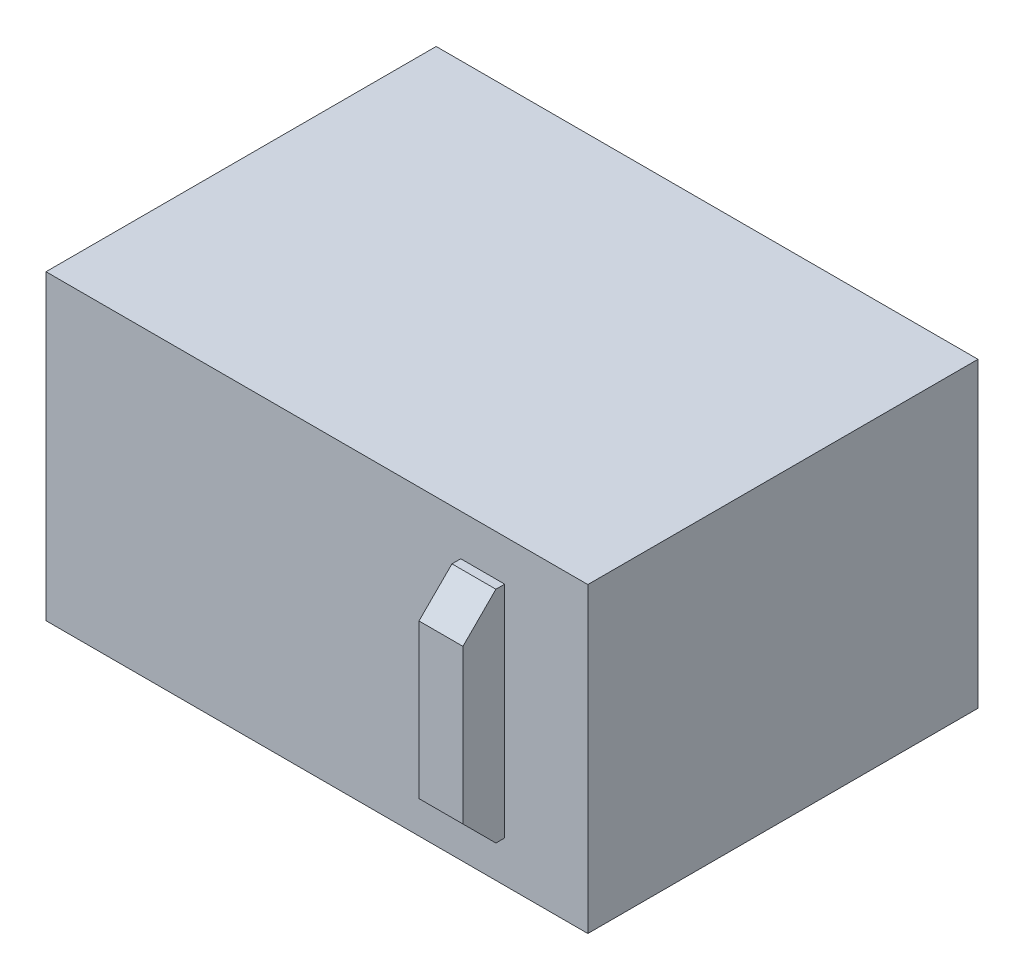
ISO-10303-21;
HEADER;
FILE_DESCRIPTION(('STEP AP214'),'2;1');
FILE_NAME('part.step','',(''),(''),'','','');
FILE_SCHEMA(('AUTOMOTIVE_DESIGN { 1 0 10303 214 1 1 1 1 }'));
ENDSEC;
DATA;
#1=APPLICATION_CONTEXT('core data for automotive mechanical design processes');
#2=APPLICATION_PROTOCOL_DEFINITION('international standard','automotive_design',2000,#1);
#3=PRODUCT_CONTEXT('',#1,'mechanical');
#4=PRODUCT('Part','Part','',(#3));
#5=PRODUCT_RELATED_PRODUCT_CATEGORY('part','',(#4));
#6=PRODUCT_DEFINITION_FORMATION('','',#4);
#7=PRODUCT_DEFINITION_CONTEXT('part definition',#1,'design');
#8=PRODUCT_DEFINITION('design','',#6,#7);
#9=PRODUCT_DEFINITION_SHAPE('','',#8);
#10=(LENGTH_UNIT() NAMED_UNIT(*) SI_UNIT(.MILLI.,.METRE.));
#11=(NAMED_UNIT(*) PLANE_ANGLE_UNIT() SI_UNIT($,.RADIAN.));
#12=(NAMED_UNIT(*) SI_UNIT($,.STERADIAN.) SOLID_ANGLE_UNIT());
#13=UNCERTAINTY_MEASURE_WITH_UNIT(LENGTH_MEASURE(1.E-05),#10,'distance_accuracy_value','');
#14=(GEOMETRIC_REPRESENTATION_CONTEXT(3) GLOBAL_UNCERTAINTY_ASSIGNED_CONTEXT((#13)) GLOBAL_UNIT_ASSIGNED_CONTEXT((#10,
#11,#12)) REPRESENTATION_CONTEXT('',''));
#15=CARTESIAN_POINT('',(0.,0.,0.));
#16=DIRECTION('',(0.,0.,1.));
#17=DIRECTION('',(1.,0.,0.));
#18=AXIS2_PLACEMENT_3D('',#15,#16,#17);
#19=CARTESIAN_POINT('',(246.5,275.,177.5));
#20=DIRECTION('',(0.,0.,-1.));
#21=DIRECTION('',(-1.,0.,0.));
#22=AXIS2_PLACEMENT_3D('',#19,#20,#21);
#23=PLANE('',#22);
#24=DIRECTION('',(1.,0.,0.));
#25=VECTOR('',#24,1.);
#26=CARTESIAN_POINT('',(246.5,0.,177.5));
#27=LINE('',#26,#25);
#28=CARTESIAN_POINT('',(-246.5,0.,177.5));
#29=VERTEX_POINT('',#28);
#30=CARTESIAN_POINT('',(246.5,0.,177.5));
#31=VERTEX_POINT('',#30);
#32=EDGE_CURVE('E156',#29,#31,#27,.T.);
#33=ORIENTED_EDGE('',*,*,#32,.T.);
#34=DIRECTION('',(0.,-1.,0.));
#35=VECTOR('',#34,1.);
#36=CARTESIAN_POINT('',(246.5,275.,177.5));
#37=LINE('',#36,#35);
#38=CARTESIAN_POINT('',(246.5,275.,177.5));
#39=VERTEX_POINT('',#38);
#40=EDGE_CURVE('E166',#39,#31,#37,.T.);
#41=ORIENTED_EDGE('',*,*,#40,.F.);
#42=DIRECTION('',(1.,0.,0.));
#43=VECTOR('',#42,1.);
#44=CARTESIAN_POINT('',(246.5,275.,177.5));
#45=LINE('',#44,#43);
#46=CARTESIAN_POINT('',(-246.5,275.,177.5));
#47=VERTEX_POINT('',#46);
#48=EDGE_CURVE('E146',#47,#39,#45,.T.);
#49=ORIENTED_EDGE('',*,*,#48,.F.);
#50=DIRECTION('',(0.,-1.,0.));
#51=VECTOR('',#50,1.);
#52=CARTESIAN_POINT('',(-246.5,275.,177.5));
#53=LINE('',#52,#51);
#54=EDGE_CURVE('E169',#47,#29,#53,.T.);
#55=ORIENTED_EDGE('',*,*,#54,.T.);
#56=EDGE_LOOP('',(#33,#41,#49,#55));
#57=FACE_BOUND('',#56,.T.);
#58=DIRECTION('',(0.,-1.,0.));
#59=VECTOR('',#58,1.);
#60=CARTESIAN_POINT('',(130.868479838721,37.5000000000001,177.5));
#61=LINE('',#60,#59);
#62=CARTESIAN_POINT('',(130.868479838721,237.5,177.5));
#63=VERTEX_POINT('',#62);
#64=CARTESIAN_POINT('',(130.868479838721,37.5000000000001,177.5));
#65=VERTEX_POINT('',#64);
#66=EDGE_CURVE('E111',#63,#65,#61,.T.);
#67=ORIENTED_EDGE('',*,*,#66,.F.);
#68=DIRECTION('',(-1.,0.,0.));
#69=VECTOR('',#68,1.);
#70=CARTESIAN_POINT('',(170.868479838721,237.5,177.5));
#71=LINE('',#70,#69);
#72=CARTESIAN_POINT('',(170.868479838721,237.5,177.5));
#73=VERTEX_POINT('',#72);
#74=EDGE_CURVE('E122',#73,#63,#71,.T.);
#75=ORIENTED_EDGE('',*,*,#74,.F.);
#76=DIRECTION('',(0.,1.,0.));
#77=VECTOR('',#76,1.);
#78=CARTESIAN_POINT('',(170.868479838721,37.5000000000001,177.5));
#79=LINE('',#78,#77);
#80=CARTESIAN_POINT('',(170.868479838721,37.5000000000001,177.5));
#81=VERTEX_POINT('',#80);
#82=EDGE_CURVE('E130',#81,#73,#79,.T.);
#83=ORIENTED_EDGE('',*,*,#82,.F.);
#84=DIRECTION('',(1.,0.,0.));
#85=VECTOR('',#84,1.);
#86=CARTESIAN_POINT('',(170.868479838721,37.5000000000001,177.5));
#87=LINE('',#86,#85);
#88=EDGE_CURVE('E125',#65,#81,#87,.T.);
#89=ORIENTED_EDGE('',*,*,#88,.F.);
#90=EDGE_LOOP('',(#67,#75,#83,#89));
#91=FACE_BOUND('',#90,.T.);
#92=ADVANCED_FACE('F33',(#57,#91),#23,.F.);
#93=CARTESIAN_POINT('',(-246.5,275.,177.5));
#94=DIRECTION('',(1.,0.,0.));
#95=DIRECTION('',(0.,0.,-1.));
#96=AXIS2_PLACEMENT_3D('',#93,#94,#95);
#97=PLANE('',#96);
#98=DIRECTION('',(0.,0.,1.));
#99=VECTOR('',#98,1.);
#100=CARTESIAN_POINT('',(-246.5,0.,177.5));
#101=LINE('',#100,#99);
#102=CARTESIAN_POINT('',(-246.5,0.,-177.5));
#103=VERTEX_POINT('',#102);
#104=EDGE_CURVE('E142',#103,#29,#101,.T.);
#105=ORIENTED_EDGE('',*,*,#104,.T.);
#106=ORIENTED_EDGE('',*,*,#54,.F.);
#107=DIRECTION('',(0.,0.,1.));
#108=VECTOR('',#107,1.);
#109=CARTESIAN_POINT('',(-246.5,275.,177.5));
#110=LINE('',#109,#108);
#111=CARTESIAN_POINT('',(-246.5,275.,-177.5));
#112=VERTEX_POINT('',#111);
#113=EDGE_CURVE('E143',#112,#47,#110,.T.);
#114=ORIENTED_EDGE('',*,*,#113,.F.);
#115=DIRECTION('',(0.,-1.,0.));
#116=VECTOR('',#115,1.);
#117=CARTESIAN_POINT('',(-246.5,275.,-177.5));
#118=LINE('',#117,#116);
#119=EDGE_CURVE('E153',#112,#103,#118,.T.);
#120=ORIENTED_EDGE('',*,*,#119,.T.);
#121=EDGE_LOOP('',(#105,#106,#114,#120));
#122=FACE_BOUND('',#121,.T.);
#123=ADVANCED_FACE('F203',(#122),#97,.F.);
#124=CARTESIAN_POINT('',(246.5,275.,177.5));
#125=DIRECTION('',(-1.,0.,0.));
#126=DIRECTION('',(0.,0.,1.));
#127=AXIS2_PLACEMENT_3D('',#124,#125,#126);
#128=PLANE('',#127);
#129=DIRECTION('',(0.,0.,-1.));
#130=VECTOR('',#129,1.);
#131=CARTESIAN_POINT('',(246.5,0.,177.5));
#132=LINE('',#131,#130);
#133=CARTESIAN_POINT('',(246.5,0.,-177.5));
#134=VERTEX_POINT('',#133);
#135=EDGE_CURVE('E158',#31,#134,#132,.T.);
#136=ORIENTED_EDGE('',*,*,#135,.T.);
#137=DIRECTION('',(0.,-1.,0.));
#138=VECTOR('',#137,1.);
#139=CARTESIAN_POINT('',(246.5,275.,-177.5));
#140=LINE('',#139,#138);
#141=CARTESIAN_POINT('',(246.5,275.,-177.5));
#142=VERTEX_POINT('',#141);
#143=EDGE_CURVE('E163',#142,#134,#140,.T.);
#144=ORIENTED_EDGE('',*,*,#143,.F.);
#145=DIRECTION('',(0.,0.,-1.));
#146=VECTOR('',#145,1.);
#147=CARTESIAN_POINT('',(246.5,275.,177.5));
#148=LINE('',#147,#146);
#149=EDGE_CURVE('E149',#39,#142,#148,.T.);
#150=ORIENTED_EDGE('',*,*,#149,.F.);
#151=ORIENTED_EDGE('',*,*,#40,.T.);
#152=EDGE_LOOP('',(#136,#144,#150,#151));
#153=FACE_BOUND('',#152,.T.);
#154=ADVANCED_FACE('F209',(#153),#128,.F.);
#155=CARTESIAN_POINT('',(246.5,275.,-177.5));
#156=DIRECTION('',(0.,0.,1.));
#157=DIRECTION('',(1.,0.,0.));
#158=AXIS2_PLACEMENT_3D('',#155,#156,#157);
#159=PLANE('',#158);
#160=DIRECTION('',(-1.,0.,0.));
#161=VECTOR('',#160,1.);
#162=CARTESIAN_POINT('',(246.5,0.,-177.5));
#163=LINE('',#162,#161);
#164=EDGE_CURVE('E147',#134,#103,#163,.T.);
#165=ORIENTED_EDGE('',*,*,#164,.T.);
#166=ORIENTED_EDGE('',*,*,#119,.F.);
#167=DIRECTION('',(-1.,0.,0.));
#168=VECTOR('',#167,1.);
#169=CARTESIAN_POINT('',(246.5,275.,-177.5));
#170=LINE('',#169,#168);
#171=EDGE_CURVE('E151',#142,#112,#170,.T.);
#172=ORIENTED_EDGE('',*,*,#171,.F.);
#173=ORIENTED_EDGE('',*,*,#143,.T.);
#174=EDGE_LOOP('',(#165,#166,#172,#173));
#175=FACE_BOUND('',#174,.T.);
#176=ADVANCED_FACE('F215',(#175),#159,.F.);
#177=CARTESIAN_POINT('',(0.,275.,0.));
#178=DIRECTION('',(0.,1.,0.));
#179=DIRECTION('',(0.,0.,1.));
#180=AXIS2_PLACEMENT_3D('',#177,#178,#179);
#181=PLANE('',#180);
#182=ORIENTED_EDGE('',*,*,#113,.T.);
#183=ORIENTED_EDGE('',*,*,#48,.T.);
#184=ORIENTED_EDGE('',*,*,#149,.T.);
#185=ORIENTED_EDGE('',*,*,#171,.T.);
#186=EDGE_LOOP('',(#182,#183,#184,#185));
#187=FACE_BOUND('',#186,.T.);
#188=ADVANCED_FACE('F219',(#187),#181,.T.);
#189=CARTESIAN_POINT('',(0.,0.,0.));
#190=DIRECTION('',(0.,1.,0.));
#191=DIRECTION('',(0.,0.,1.));
#192=AXIS2_PLACEMENT_3D('',#189,#190,#191);
#193=PLANE('',#192);
#194=ORIENTED_EDGE('',*,*,#104,.F.);
#195=ORIENTED_EDGE('',*,*,#164,.F.);
#196=ORIENTED_EDGE('',*,*,#135,.F.);
#197=ORIENTED_EDGE('',*,*,#32,.F.);
#198=EDGE_LOOP('',(#194,#195,#196,#197));
#199=FACE_BOUND('',#198,.T.);
#200=ADVANCED_FACE('F221',(#199),#193,.F.);
#201=CARTESIAN_POINT('',(130.868479838721,37.5000000000001,215.5));
#202=DIRECTION('',(1.,0.,0.));
#203=DIRECTION('',(0.,0.,-1.));
#204=AXIS2_PLACEMENT_3D('',#201,#202,#203);
#205=PLANE('',#204);
#206=DIRECTION('',(0.,0.,-1.));
#207=VECTOR('',#206,1.);
#208=CARTESIAN_POINT('',(130.868479838721,37.5000000000001,215.5));
#209=LINE('',#208,#207);
#210=CARTESIAN_POINT('',(130.868479838721,37.5000000000001,185.5));
#211=VERTEX_POINT('',#210);
#212=EDGE_CURVE('E140',#211,#65,#209,.T.);
#213=ORIENTED_EDGE('',*,*,#212,.F.);
#214=DIRECTION('',(0.,0.707106781186546,0.707106781186549));
#215=VECTOR('',#214,1.);
#216=CARTESIAN_POINT('',(130.868479838721,67.5000000000002,215.5));
#217=LINE('',#216,#215);
#218=CARTESIAN_POINT('',(130.868479838721,67.5000000000002,215.5));
#219=VERTEX_POINT('',#218);
#220=EDGE_CURVE('E41',#211,#219,#217,.T.);
#221=ORIENTED_EDGE('',*,*,#220,.T.);
#222=DIRECTION('',(0.,-1.,0.));
#223=VECTOR('',#222,1.);
#224=CARTESIAN_POINT('',(130.868479838721,37.5000000000001,215.5));
#225=LINE('',#224,#223);
#226=CARTESIAN_POINT('',(130.868479838721,207.5,215.5));
#227=VERTEX_POINT('',#226);
#228=EDGE_CURVE('E129',#227,#219,#225,.T.);
#229=ORIENTED_EDGE('',*,*,#228,.F.);
#230=DIRECTION('',(0.,0.707106781186546,-0.707106781186549));
#231=VECTOR('',#230,1.);
#232=CARTESIAN_POINT('',(130.868479838721,207.5,215.5));
#233=LINE('',#232,#231);
#234=CARTESIAN_POINT('',(130.868479838721,237.5,185.5));
#235=VERTEX_POINT('',#234);
#236=EDGE_CURVE('E48',#227,#235,#233,.T.);
#237=ORIENTED_EDGE('',*,*,#236,.T.);
#238=DIRECTION('',(0.,0.,-1.));
#239=VECTOR('',#238,1.);
#240=CARTESIAN_POINT('',(130.868479838721,237.5,215.5));
#241=LINE('',#240,#239);
#242=EDGE_CURVE('E108',#235,#63,#241,.T.);
#243=ORIENTED_EDGE('',*,*,#242,.T.);
#244=ORIENTED_EDGE('',*,*,#66,.T.);
#245=EDGE_LOOP('',(#213,#221,#229,#237,#243,#244));
#246=FACE_BOUND('',#245,.T.);
#247=ADVANCED_FACE('F110',(#246),#205,.F.);
#248=CARTESIAN_POINT('',(170.868479838721,37.5000000000001,215.5));
#249=DIRECTION('',(0.,1.,0.));
#250=DIRECTION('',(-1.,0.,0.));
#251=AXIS2_PLACEMENT_3D('',#248,#249,#250);
#252=PLANE('',#251);
#253=DIRECTION('',(0.,0.,-1.));
#254=VECTOR('',#253,1.);
#255=CARTESIAN_POINT('',(170.868479838721,37.5000000000001,215.5));
#256=LINE('',#255,#254);
#257=CARTESIAN_POINT('',(170.868479838721,37.5000000000001,185.5));
#258=VERTEX_POINT('',#257);
#259=EDGE_CURVE('E138',#258,#81,#256,.T.);
#260=ORIENTED_EDGE('',*,*,#259,.F.);
#261=DIRECTION('',(-1.,0.,0.));
#262=VECTOR('',#261,1.);
#263=CARTESIAN_POINT('',(130.868479838721,37.5000000000001,185.5));
#264=LINE('',#263,#262);
#265=EDGE_CURVE('E56',#258,#211,#264,.T.);
#266=ORIENTED_EDGE('',*,*,#265,.T.);
#267=ORIENTED_EDGE('',*,*,#212,.T.);
#268=ORIENTED_EDGE('',*,*,#88,.T.);
#269=EDGE_LOOP('',(#260,#266,#267,#268));
#270=FACE_BOUND('',#269,.T.);
#271=ADVANCED_FACE('F194',(#270),#252,.F.);
#272=CARTESIAN_POINT('',(170.868479838721,37.5000000000001,215.5));
#273=DIRECTION('',(-1.,0.,0.));
#274=DIRECTION('',(0.,0.,1.));
#275=AXIS2_PLACEMENT_3D('',#272,#273,#274);
#276=PLANE('',#275);
#277=DIRECTION('',(0.,1.,0.));
#278=VECTOR('',#277,1.);
#279=CARTESIAN_POINT('',(170.868479838721,37.5000000000001,215.5));
#280=LINE('',#279,#278);
#281=CARTESIAN_POINT('',(170.868479838721,67.5000000000002,215.5));
#282=VERTEX_POINT('',#281);
#283=CARTESIAN_POINT('',(170.868479838721,207.5,215.5));
#284=VERTEX_POINT('',#283);
#285=EDGE_CURVE('E116',#282,#284,#280,.T.);
#286=ORIENTED_EDGE('',*,*,#285,.F.);
#287=DIRECTION('',(0.,-0.707106781186546,-0.707106781186549));
#288=VECTOR('',#287,1.);
#289=CARTESIAN_POINT('',(170.868479838721,67.5000000000002,215.5));
#290=LINE('',#289,#288);
#291=EDGE_CURVE('E180',#282,#258,#290,.T.);
#292=ORIENTED_EDGE('',*,*,#291,.T.);
#293=ORIENTED_EDGE('',*,*,#259,.T.);
#294=ORIENTED_EDGE('',*,*,#82,.T.);
#295=DIRECTION('',(0.,0.,-1.));
#296=VECTOR('',#295,1.);
#297=CARTESIAN_POINT('',(170.868479838721,237.5,215.5));
#298=LINE('',#297,#296);
#299=CARTESIAN_POINT('',(170.868479838721,237.5,185.5));
#300=VERTEX_POINT('',#299);
#301=EDGE_CURVE('E115',#300,#73,#298,.T.);
#302=ORIENTED_EDGE('',*,*,#301,.F.);
#303=DIRECTION('',(0.,-0.707106781186546,0.707106781186549));
#304=VECTOR('',#303,1.);
#305=CARTESIAN_POINT('',(170.868479838721,207.5,215.5));
#306=LINE('',#305,#304);
#307=EDGE_CURVE('E178',#300,#284,#306,.T.);
#308=ORIENTED_EDGE('',*,*,#307,.T.);
#309=EDGE_LOOP('',(#286,#292,#293,#294,#302,#308));
#310=FACE_BOUND('',#309,.T.);
#311=ADVANCED_FACE('F193',(#310),#276,.F.);
#312=CARTESIAN_POINT('',(170.868479838721,237.5,215.5));
#313=DIRECTION('',(0.,-1.,0.));
#314=DIRECTION('',(0.,0.,-1.));
#315=AXIS2_PLACEMENT_3D('',#312,#313,#314);
#316=PLANE('',#315);
#317=ORIENTED_EDGE('',*,*,#242,.F.);
#318=DIRECTION('',(1.,0.,0.));
#319=VECTOR('',#318,1.);
#320=CARTESIAN_POINT('',(170.868479838721,237.5,185.5));
#321=LINE('',#320,#319);
#322=EDGE_CURVE('E11',#235,#300,#321,.T.);
#323=ORIENTED_EDGE('',*,*,#322,.T.);
#324=ORIENTED_EDGE('',*,*,#301,.T.);
#325=ORIENTED_EDGE('',*,*,#74,.T.);
#326=EDGE_LOOP('',(#317,#323,#324,#325));
#327=FACE_BOUND('',#326,.T.);
#328=ADVANCED_FACE('F127',(#327),#316,.F.);
#329=CARTESIAN_POINT('',(0.,0.,215.5));
#330=DIRECTION('',(0.,0.,1.));
#331=DIRECTION('',(1.,0.,0.));
#332=AXIS2_PLACEMENT_3D('',#329,#330,#331);
#333=PLANE('',#332);
#334=ORIENTED_EDGE('',*,*,#228,.T.);
#335=DIRECTION('',(1.,0.,0.));
#336=VECTOR('',#335,1.);
#337=CARTESIAN_POINT('',(170.868479838721,67.5000000000002,215.5));
#338=LINE('',#337,#336);
#339=EDGE_CURVE('E175',#219,#282,#338,.T.);
#340=ORIENTED_EDGE('',*,*,#339,.T.);
#341=ORIENTED_EDGE('',*,*,#285,.T.);
#342=DIRECTION('',(-1.,0.,0.));
#343=VECTOR('',#342,1.);
#344=CARTESIAN_POINT('',(130.868479838721,207.5,215.5));
#345=LINE('',#344,#343);
#346=EDGE_CURVE('E172',#284,#227,#345,.T.);
#347=ORIENTED_EDGE('',*,*,#346,.T.);
#348=EDGE_LOOP('',(#334,#340,#341,#347));
#349=FACE_BOUND('',#348,.T.);
#350=ADVANCED_FACE('F187',(#349),#333,.T.);
#351=CARTESIAN_POINT('',(0.,67.5000000000001,215.5));
#352=DIRECTION('',(0.,-0.707106781186549,0.707106781186546));
#353=DIRECTION('',(-1.,0.,0.));
#354=AXIS2_PLACEMENT_3D('',#351,#352,#353);
#355=PLANE('',#354);
#356=ORIENTED_EDGE('',*,*,#220,.F.);
#357=ORIENTED_EDGE('',*,*,#265,.F.);
#358=ORIENTED_EDGE('',*,*,#291,.F.);
#359=ORIENTED_EDGE('',*,*,#339,.F.);
#360=EDGE_LOOP('',(#356,#357,#358,#359));
#361=FACE_BOUND('',#360,.T.);
#362=ADVANCED_FACE('F191',(#361),#355,.T.);
#363=CARTESIAN_POINT('',(0.,207.5,215.5));
#364=DIRECTION('',(0.,0.707106781186549,0.707106781186546));
#365=DIRECTION('',(1.,0.,0.));
#366=AXIS2_PLACEMENT_3D('',#363,#364,#365);
#367=PLANE('',#366);
#368=ORIENTED_EDGE('',*,*,#307,.F.);
#369=ORIENTED_EDGE('',*,*,#322,.F.);
#370=ORIENTED_EDGE('',*,*,#236,.F.);
#371=ORIENTED_EDGE('',*,*,#346,.F.);
#372=EDGE_LOOP('',(#368,#369,#370,#371));
#373=FACE_BOUND('',#372,.T.);
#374=ADVANCED_FACE('F35',(#373),#367,.T.);
#375=CLOSED_SHELL('',(#92,#123,#154,#176,#188,#200,#247,#271,#311,#328,#350,#362,#374));
#376=MANIFOLD_SOLID_BREP('B2',#375);
#377=ADVANCED_BREP_SHAPE_REPRESENTATION('',(#18,#376),#14);
#378=SHAPE_DEFINITION_REPRESENTATION(#9,#377);
ENDSEC;
END-ISO-10303-21;
